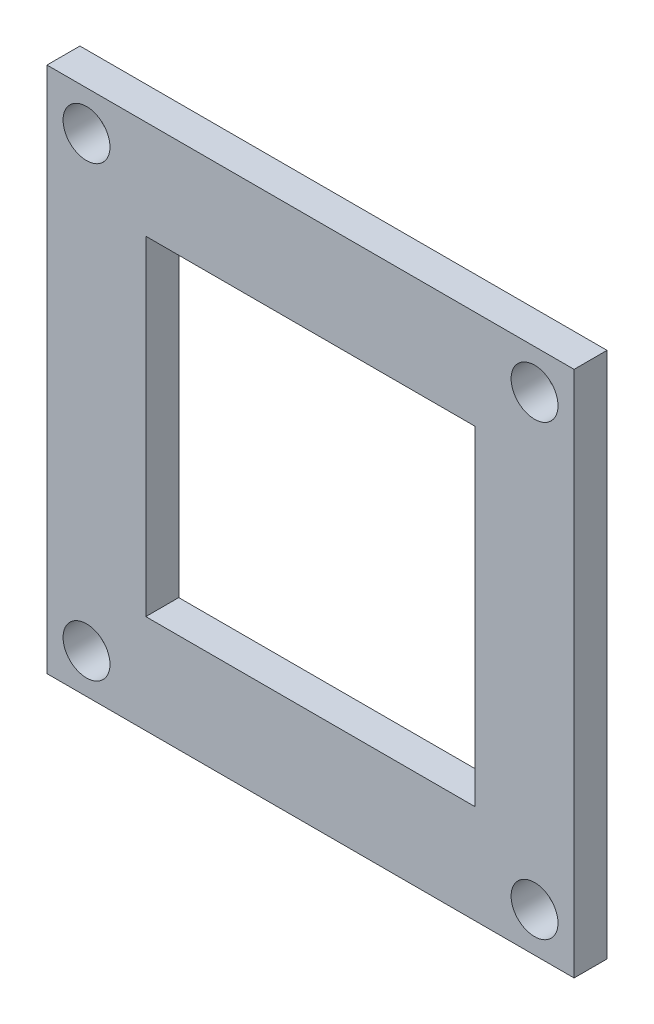
ISO-10303-21;
HEADER;
FILE_DESCRIPTION(('STEP AP214'),'2;1');
FILE_NAME('part.step','',(''),(''),'','','');
FILE_SCHEMA(('AUTOMOTIVE_DESIGN { 1 0 10303 214 1 1 1 1 }'));
ENDSEC;
DATA;
#1=APPLICATION_CONTEXT('core data for automotive mechanical design processes');
#2=APPLICATION_PROTOCOL_DEFINITION('international standard','automotive_design',2000,#1);
#3=PRODUCT_CONTEXT('',#1,'mechanical');
#4=PRODUCT('Part','Part','',(#3));
#5=PRODUCT_RELATED_PRODUCT_CATEGORY('part','',(#4));
#6=PRODUCT_DEFINITION_FORMATION('','',#4);
#7=PRODUCT_DEFINITION_CONTEXT('part definition',#1,'design');
#8=PRODUCT_DEFINITION('design','',#6,#7);
#9=PRODUCT_DEFINITION_SHAPE('','',#8);
#10=(LENGTH_UNIT() NAMED_UNIT(*) SI_UNIT(.MILLI.,.METRE.));
#11=(NAMED_UNIT(*) PLANE_ANGLE_UNIT() SI_UNIT($,.RADIAN.));
#12=(NAMED_UNIT(*) SI_UNIT($,.STERADIAN.) SOLID_ANGLE_UNIT());
#13=UNCERTAINTY_MEASURE_WITH_UNIT(LENGTH_MEASURE(1.E-05),#10,'distance_accuracy_value','');
#14=(GEOMETRIC_REPRESENTATION_CONTEXT(3) GLOBAL_UNCERTAINTY_ASSIGNED_CONTEXT((#13)) GLOBAL_UNIT_ASSIGNED_CONTEXT((#10,
#11,#12)) REPRESENTATION_CONTEXT('',''));
#15=CARTESIAN_POINT('',(0.,0.,0.));
#16=DIRECTION('',(0.,0.,1.));
#17=DIRECTION('',(1.,0.,0.));
#18=AXIS2_PLACEMENT_3D('',#15,#16,#17);
#19=CARTESIAN_POINT('',(0.,0.,1.5875));
#20=DIRECTION('',(0.,0.,1.));
#21=DIRECTION('',(1.,0.,0.));
#22=AXIS2_PLACEMENT_3D('',#19,#20,#21);
#23=PLANE('',#22);
#24=CARTESIAN_POINT('',(10.795,10.795,1.5875));
#25=DIRECTION('',(0.,0.,1.));
#26=DIRECTION('',(1.,0.,0.));
#27=AXIS2_PLACEMENT_3D('',#24,#25,#26);
#28=CIRCLE('',#27,1.1303);
#29=CARTESIAN_POINT('',(11.9253,10.795,1.5875));
#30=VERTEX_POINT('',#29);
#31=EDGE_CURVE('E239',#30,#30,#28,.T.);
#32=ORIENTED_EDGE('',*,*,#31,.F.);
#33=EDGE_LOOP('',(#32));
#34=FACE_BOUND('',#33,.T.);
#35=CARTESIAN_POINT('',(-10.795,10.795,1.5875));
#36=DIRECTION('',(0.,0.,1.));
#37=DIRECTION('',(1.,0.,0.));
#38=AXIS2_PLACEMENT_3D('',#35,#36,#37);
#39=CIRCLE('',#38,1.1303);
#40=CARTESIAN_POINT('',(-9.6647,10.795,1.5875));
#41=VERTEX_POINT('',#40);
#42=EDGE_CURVE('E241',#41,#41,#39,.T.);
#43=ORIENTED_EDGE('',*,*,#42,.F.);
#44=EDGE_LOOP('',(#43));
#45=FACE_BOUND('',#44,.T.);
#46=CARTESIAN_POINT('',(-10.795,-10.795,1.5875));
#47=DIRECTION('',(0.,0.,1.));
#48=DIRECTION('',(1.,0.,0.));
#49=AXIS2_PLACEMENT_3D('',#46,#47,#48);
#50=CIRCLE('',#49,1.1303);
#51=CARTESIAN_POINT('',(-9.6647,-10.795,1.5875));
#52=VERTEX_POINT('',#51);
#53=EDGE_CURVE('E249',#52,#52,#50,.T.);
#54=ORIENTED_EDGE('',*,*,#53,.F.);
#55=EDGE_LOOP('',(#54));
#56=FACE_BOUND('',#55,.T.);
#57=CARTESIAN_POINT('',(10.795,-10.795,1.5875));
#58=DIRECTION('',(0.,0.,1.));
#59=DIRECTION('',(1.,0.,0.));
#60=AXIS2_PLACEMENT_3D('',#57,#58,#59);
#61=CIRCLE('',#60,1.1303);
#62=CARTESIAN_POINT('',(11.9253,-10.795,1.5875));
#63=VERTEX_POINT('',#62);
#64=EDGE_CURVE('E255',#63,#63,#61,.T.);
#65=ORIENTED_EDGE('',*,*,#64,.F.);
#66=EDGE_LOOP('',(#65));
#67=FACE_BOUND('',#66,.T.);
#68=DIRECTION('',(0.,1.,0.));
#69=VECTOR('',#68,1.);
#70=CARTESIAN_POINT('',(12.7,12.7,1.5875));
#71=LINE('',#70,#69);
#72=CARTESIAN_POINT('',(12.7,-12.7,1.5875));
#73=VERTEX_POINT('',#72);
#74=CARTESIAN_POINT('',(12.7,12.7,1.5875));
#75=VERTEX_POINT('',#74);
#76=EDGE_CURVE('E136',#73,#75,#71,.T.);
#77=ORIENTED_EDGE('',*,*,#76,.T.);
#78=DIRECTION('',(-1.,0.,0.));
#79=VECTOR('',#78,1.);
#80=CARTESIAN_POINT('',(-12.7,12.7,1.5875));
#81=LINE('',#80,#79);
#82=CARTESIAN_POINT('',(-12.7,12.7,1.5875));
#83=VERTEX_POINT('',#82);
#84=EDGE_CURVE('E139',#75,#83,#81,.T.);
#85=ORIENTED_EDGE('',*,*,#84,.T.);
#86=DIRECTION('',(0.,-1.,0.));
#87=VECTOR('',#86,1.);
#88=CARTESIAN_POINT('',(-12.7,12.7,1.5875));
#89=LINE('',#88,#87);
#90=CARTESIAN_POINT('',(-12.7,-12.7,1.5875));
#91=VERTEX_POINT('',#90);
#92=EDGE_CURVE('E142',#83,#91,#89,.T.);
#93=ORIENTED_EDGE('',*,*,#92,.T.);
#94=DIRECTION('',(1.,0.,0.));
#95=VECTOR('',#94,1.);
#96=CARTESIAN_POINT('',(-12.7,-12.7,1.5875));
#97=LINE('',#96,#95);
#98=EDGE_CURVE('E144',#91,#73,#97,.T.);
#99=ORIENTED_EDGE('',*,*,#98,.T.);
#100=EDGE_LOOP('',(#77,#85,#93,#99));
#101=FACE_BOUND('',#100,.T.);
#102=DIRECTION('',(-1.,0.,0.));
#103=VECTOR('',#102,1.);
#104=CARTESIAN_POINT('',(-7.9375,7.9375,1.5875));
#105=LINE('',#104,#103);
#106=CARTESIAN_POINT('',(7.9375,7.9375,1.5875));
#107=VERTEX_POINT('',#106);
#108=CARTESIAN_POINT('',(-7.9375,7.9375,1.5875));
#109=VERTEX_POINT('',#108);
#110=EDGE_CURVE('E106',#107,#109,#105,.T.);
#111=ORIENTED_EDGE('',*,*,#110,.F.);
#112=DIRECTION('',(0.,1.,0.));
#113=VECTOR('',#112,1.);
#114=CARTESIAN_POINT('',(7.9375,7.9375,1.5875));
#115=LINE('',#114,#113);
#116=CARTESIAN_POINT('',(7.9375,-7.9375,1.5875));
#117=VERTEX_POINT('',#116);
#118=EDGE_CURVE('E98',#117,#107,#115,.T.);
#119=ORIENTED_EDGE('',*,*,#118,.F.);
#120=DIRECTION('',(1.,0.,0.));
#121=VECTOR('',#120,1.);
#122=CARTESIAN_POINT('',(-7.9375,-7.9375,1.5875));
#123=LINE('',#122,#121);
#124=CARTESIAN_POINT('',(-7.9375,-7.9375,1.5875));
#125=VERTEX_POINT('',#124);
#126=EDGE_CURVE('E120',#125,#117,#123,.T.);
#127=ORIENTED_EDGE('',*,*,#126,.F.);
#128=DIRECTION('',(0.,-1.,0.));
#129=VECTOR('',#128,1.);
#130=CARTESIAN_POINT('',(-7.9375,7.9375,1.5875));
#131=LINE('',#130,#129);
#132=EDGE_CURVE('E118',#109,#125,#131,.T.);
#133=ORIENTED_EDGE('',*,*,#132,.F.);
#134=EDGE_LOOP('',(#111,#119,#127,#133));
#135=FACE_BOUND('',#134,.T.);
#136=ADVANCED_FACE('F33',(#34,#45,#56,#67,#101,#135),#23,.T.);
#137=CARTESIAN_POINT('',(0.,0.,0.));
#138=DIRECTION('',(0.,0.,1.));
#139=DIRECTION('',(1.,0.,0.));
#140=AXIS2_PLACEMENT_3D('',#137,#138,#139);
#141=PLANE('',#140);
#142=CARTESIAN_POINT('',(10.795,10.795,0.));
#143=DIRECTION('',(0.,0.,1.));
#144=DIRECTION('',(1.,0.,0.));
#145=AXIS2_PLACEMENT_3D('',#142,#143,#144);
#146=CIRCLE('',#145,1.1303);
#147=CARTESIAN_POINT('',(11.9253,10.795,0.));
#148=VERTEX_POINT('',#147);
#149=EDGE_CURVE('E237',#148,#148,#146,.T.);
#150=ORIENTED_EDGE('',*,*,#149,.T.);
#151=EDGE_LOOP('',(#150));
#152=FACE_BOUND('',#151,.T.);
#153=CARTESIAN_POINT('',(-10.795,10.795,0.));
#154=DIRECTION('',(0.,0.,1.));
#155=DIRECTION('',(1.,0.,0.));
#156=AXIS2_PLACEMENT_3D('',#153,#154,#155);
#157=CIRCLE('',#156,1.1303);
#158=CARTESIAN_POINT('',(-9.66470000000001,10.795,0.));
#159=VERTEX_POINT('',#158);
#160=EDGE_CURVE('E246',#159,#159,#157,.T.);
#161=ORIENTED_EDGE('',*,*,#160,.T.);
#162=EDGE_LOOP('',(#161));
#163=FACE_BOUND('',#162,.T.);
#164=CARTESIAN_POINT('',(-10.795,-10.795,0.));
#165=DIRECTION('',(0.,0.,1.));
#166=DIRECTION('',(1.,0.,0.));
#167=AXIS2_PLACEMENT_3D('',#164,#165,#166);
#168=CIRCLE('',#167,1.1303);
#169=CARTESIAN_POINT('',(-9.6647,-10.795,0.));
#170=VERTEX_POINT('',#169);
#171=EDGE_CURVE('E252',#170,#170,#168,.T.);
#172=ORIENTED_EDGE('',*,*,#171,.T.);
#173=EDGE_LOOP('',(#172));
#174=FACE_BOUND('',#173,.T.);
#175=CARTESIAN_POINT('',(10.795,-10.795,0.));
#176=DIRECTION('',(0.,0.,1.));
#177=DIRECTION('',(1.,0.,0.));
#178=AXIS2_PLACEMENT_3D('',#175,#176,#177);
#179=CIRCLE('',#178,1.1303);
#180=CARTESIAN_POINT('',(11.9253,-10.795,0.));
#181=VERTEX_POINT('',#180);
#182=EDGE_CURVE('E126',#181,#181,#179,.T.);
#183=ORIENTED_EDGE('',*,*,#182,.T.);
#184=EDGE_LOOP('',(#183));
#185=FACE_BOUND('',#184,.T.);
#186=DIRECTION('',(0.,1.,0.));
#187=VECTOR('',#186,1.);
#188=CARTESIAN_POINT('',(12.7,12.7,0.));
#189=LINE('',#188,#187);
#190=CARTESIAN_POINT('',(12.7,-12.7,0.));
#191=VERTEX_POINT('',#190);
#192=CARTESIAN_POINT('',(12.7,12.7,0.));
#193=VERTEX_POINT('',#192);
#194=EDGE_CURVE('E114',#191,#193,#189,.T.);
#195=ORIENTED_EDGE('',*,*,#194,.F.);
#196=DIRECTION('',(1.,0.,0.));
#197=VECTOR('',#196,1.);
#198=CARTESIAN_POINT('',(-12.7,-12.7,0.));
#199=LINE('',#198,#197);
#200=CARTESIAN_POINT('',(-12.7,-12.7,0.));
#201=VERTEX_POINT('',#200);
#202=EDGE_CURVE('E140',#201,#191,#199,.T.);
#203=ORIENTED_EDGE('',*,*,#202,.F.);
#204=DIRECTION('',(0.,-1.,0.));
#205=VECTOR('',#204,1.);
#206=CARTESIAN_POINT('',(-12.7,12.7,0.));
#207=LINE('',#206,#205);
#208=CARTESIAN_POINT('',(-12.7,12.7,0.));
#209=VERTEX_POINT('',#208);
#210=EDGE_CURVE('E151',#209,#201,#207,.T.);
#211=ORIENTED_EDGE('',*,*,#210,.F.);
#212=DIRECTION('',(-1.,0.,0.));
#213=VECTOR('',#212,1.);
#214=CARTESIAN_POINT('',(-12.7,12.7,0.));
#215=LINE('',#214,#213);
#216=EDGE_CURVE('E149',#193,#209,#215,.T.);
#217=ORIENTED_EDGE('',*,*,#216,.F.);
#218=EDGE_LOOP('',(#195,#203,#211,#217));
#219=FACE_BOUND('',#218,.T.);
#220=DIRECTION('',(0.,1.,0.));
#221=VECTOR('',#220,1.);
#222=CARTESIAN_POINT('',(7.9375,7.9375,0.));
#223=LINE('',#222,#221);
#224=CARTESIAN_POINT('',(7.9375,-7.9375,0.));
#225=VERTEX_POINT('',#224);
#226=CARTESIAN_POINT('',(7.9375,7.9375,0.));
#227=VERTEX_POINT('',#226);
#228=EDGE_CURVE('E56',#225,#227,#223,.T.);
#229=ORIENTED_EDGE('',*,*,#228,.T.);
#230=DIRECTION('',(-1.,0.,0.));
#231=VECTOR('',#230,1.);
#232=CARTESIAN_POINT('',(-7.9375,7.9375,0.));
#233=LINE('',#232,#231);
#234=CARTESIAN_POINT('',(-7.9375,7.9375,0.));
#235=VERTEX_POINT('',#234);
#236=EDGE_CURVE('E113',#227,#235,#233,.T.);
#237=ORIENTED_EDGE('',*,*,#236,.T.);
#238=DIRECTION('',(0.,-1.,0.));
#239=VECTOR('',#238,1.);
#240=CARTESIAN_POINT('',(-7.9375,7.9375,0.));
#241=LINE('',#240,#239);
#242=CARTESIAN_POINT('',(-7.9375,-7.9375,0.));
#243=VERTEX_POINT('',#242);
#244=EDGE_CURVE('E128',#235,#243,#241,.T.);
#245=ORIENTED_EDGE('',*,*,#244,.T.);
#246=DIRECTION('',(1.,0.,0.));
#247=VECTOR('',#246,1.);
#248=CARTESIAN_POINT('',(-7.9375,-7.9375,0.));
#249=LINE('',#248,#247);
#250=EDGE_CURVE('E107',#243,#225,#249,.T.);
#251=ORIENTED_EDGE('',*,*,#250,.T.);
#252=EDGE_LOOP('',(#229,#237,#245,#251));
#253=FACE_BOUND('',#252,.T.);
#254=ADVANCED_FACE('F169',(#152,#163,#174,#185,#219,#253),#141,.F.);
#255=CARTESIAN_POINT('',(12.7,12.7,1.5875));
#256=DIRECTION('',(-1.,0.,0.));
#257=DIRECTION('',(0.,-1.,0.));
#258=AXIS2_PLACEMENT_3D('',#255,#256,#257);
#259=PLANE('',#258);
#260=ORIENTED_EDGE('',*,*,#194,.T.);
#261=DIRECTION('',(0.,0.,-1.));
#262=VECTOR('',#261,1.);
#263=CARTESIAN_POINT('',(12.7,12.7,1.5875));
#264=LINE('',#263,#262);
#265=EDGE_CURVE('E11',#75,#193,#264,.T.);
#266=ORIENTED_EDGE('',*,*,#265,.F.);
#267=ORIENTED_EDGE('',*,*,#76,.F.);
#268=DIRECTION('',(0.,0.,-1.));
#269=VECTOR('',#268,1.);
#270=CARTESIAN_POINT('',(12.7,-12.7,1.5875));
#271=LINE('',#270,#269);
#272=EDGE_CURVE('E146',#73,#191,#271,.T.);
#273=ORIENTED_EDGE('',*,*,#272,.T.);
#274=EDGE_LOOP('',(#260,#266,#267,#273));
#275=FACE_BOUND('',#274,.T.);
#276=ADVANCED_FACE('F35',(#275),#259,.F.);
#277=CARTESIAN_POINT('',(-12.7,12.7,1.5875));
#278=DIRECTION('',(0.,-1.,0.));
#279=DIRECTION('',(0.,0.,-1.));
#280=AXIS2_PLACEMENT_3D('',#277,#278,#279);
#281=PLANE('',#280);
#282=ORIENTED_EDGE('',*,*,#216,.T.);
#283=DIRECTION('',(0.,0.,-1.));
#284=VECTOR('',#283,1.);
#285=CARTESIAN_POINT('',(-12.7,12.7,1.5875));
#286=LINE('',#285,#284);
#287=EDGE_CURVE('E41',#83,#209,#286,.T.);
#288=ORIENTED_EDGE('',*,*,#287,.F.);
#289=ORIENTED_EDGE('',*,*,#84,.F.);
#290=ORIENTED_EDGE('',*,*,#265,.T.);
#291=EDGE_LOOP('',(#282,#288,#289,#290));
#292=FACE_BOUND('',#291,.T.);
#293=ADVANCED_FACE('F179',(#292),#281,.F.);
#294=CARTESIAN_POINT('',(-12.7,12.7,1.5875));
#295=DIRECTION('',(1.,0.,0.));
#296=DIRECTION('',(0.,1.,0.));
#297=AXIS2_PLACEMENT_3D('',#294,#295,#296);
#298=PLANE('',#297);
#299=ORIENTED_EDGE('',*,*,#210,.T.);
#300=DIRECTION('',(0.,0.,-1.));
#301=VECTOR('',#300,1.);
#302=CARTESIAN_POINT('',(-12.7,-12.7,1.5875));
#303=LINE('',#302,#301);
#304=EDGE_CURVE('E156',#91,#201,#303,.T.);
#305=ORIENTED_EDGE('',*,*,#304,.F.);
#306=ORIENTED_EDGE('',*,*,#92,.F.);
#307=ORIENTED_EDGE('',*,*,#287,.T.);
#308=EDGE_LOOP('',(#299,#305,#306,#307));
#309=FACE_BOUND('',#308,.T.);
#310=ADVANCED_FACE('F163',(#309),#298,.F.);
#311=CARTESIAN_POINT('',(-12.7,-12.7,1.5875));
#312=DIRECTION('',(0.,1.,0.));
#313=DIRECTION('',(0.,0.,1.));
#314=AXIS2_PLACEMENT_3D('',#311,#312,#313);
#315=PLANE('',#314);
#316=ORIENTED_EDGE('',*,*,#202,.T.);
#317=ORIENTED_EDGE('',*,*,#272,.F.);
#318=ORIENTED_EDGE('',*,*,#98,.F.);
#319=ORIENTED_EDGE('',*,*,#304,.T.);
#320=EDGE_LOOP('',(#316,#317,#318,#319));
#321=FACE_BOUND('',#320,.T.);
#322=ADVANCED_FACE('F173',(#321),#315,.F.);
#323=CARTESIAN_POINT('',(7.9375,7.9375,1.5875));
#324=DIRECTION('',(-1.,0.,0.));
#325=DIRECTION('',(0.,-1.,0.));
#326=AXIS2_PLACEMENT_3D('',#323,#324,#325);
#327=PLANE('',#326);
#328=ORIENTED_EDGE('',*,*,#228,.F.);
#329=DIRECTION('',(0.,0.,-1.));
#330=VECTOR('',#329,1.);
#331=CARTESIAN_POINT('',(7.9375,-7.9375,1.5875));
#332=LINE('',#331,#330);
#333=EDGE_CURVE('E102',#117,#225,#332,.T.);
#334=ORIENTED_EDGE('',*,*,#333,.F.);
#335=ORIENTED_EDGE('',*,*,#118,.T.);
#336=DIRECTION('',(0.,0.,-1.));
#337=VECTOR('',#336,1.);
#338=CARTESIAN_POINT('',(7.9375,7.9375,1.5875));
#339=LINE('',#338,#337);
#340=EDGE_CURVE('E101',#107,#227,#339,.T.);
#341=ORIENTED_EDGE('',*,*,#340,.T.);
#342=EDGE_LOOP('',(#328,#334,#335,#341));
#343=FACE_BOUND('',#342,.T.);
#344=ADVANCED_FACE('F100',(#343),#327,.T.);
#345=CARTESIAN_POINT('',(-7.9375,7.9375,1.5875));
#346=DIRECTION('',(0.,-1.,0.));
#347=DIRECTION('',(0.,0.,-1.));
#348=AXIS2_PLACEMENT_3D('',#345,#346,#347);
#349=PLANE('',#348);
#350=ORIENTED_EDGE('',*,*,#236,.F.);
#351=ORIENTED_EDGE('',*,*,#340,.F.);
#352=ORIENTED_EDGE('',*,*,#110,.T.);
#353=DIRECTION('',(0.,0.,-1.));
#354=VECTOR('',#353,1.);
#355=CARTESIAN_POINT('',(-7.9375,7.9375,1.5875));
#356=LINE('',#355,#354);
#357=EDGE_CURVE('E115',#109,#235,#356,.T.);
#358=ORIENTED_EDGE('',*,*,#357,.T.);
#359=EDGE_LOOP('',(#350,#351,#352,#358));
#360=FACE_BOUND('',#359,.T.);
#361=ADVANCED_FACE('F110',(#360),#349,.T.);
#362=CARTESIAN_POINT('',(-7.9375,7.9375,1.5875));
#363=DIRECTION('',(1.,0.,0.));
#364=DIRECTION('',(0.,1.,0.));
#365=AXIS2_PLACEMENT_3D('',#362,#363,#364);
#366=PLANE('',#365);
#367=ORIENTED_EDGE('',*,*,#244,.F.);
#368=ORIENTED_EDGE('',*,*,#357,.F.);
#369=ORIENTED_EDGE('',*,*,#132,.T.);
#370=DIRECTION('',(0.,0.,-1.));
#371=VECTOR('',#370,1.);
#372=CARTESIAN_POINT('',(-7.9375,-7.9375,1.5875));
#373=LINE('',#372,#371);
#374=EDGE_CURVE('E48',#125,#243,#373,.T.);
#375=ORIENTED_EDGE('',*,*,#374,.T.);
#376=EDGE_LOOP('',(#367,#368,#369,#375));
#377=FACE_BOUND('',#376,.T.);
#378=ADVANCED_FACE('F207',(#377),#366,.T.);
#379=CARTESIAN_POINT('',(-7.9375,-7.9375,1.5875));
#380=DIRECTION('',(0.,1.,0.));
#381=DIRECTION('',(0.,0.,1.));
#382=AXIS2_PLACEMENT_3D('',#379,#380,#381);
#383=PLANE('',#382);
#384=ORIENTED_EDGE('',*,*,#250,.F.);
#385=ORIENTED_EDGE('',*,*,#374,.F.);
#386=ORIENTED_EDGE('',*,*,#126,.T.);
#387=ORIENTED_EDGE('',*,*,#333,.T.);
#388=EDGE_LOOP('',(#384,#385,#386,#387));
#389=FACE_BOUND('',#388,.T.);
#390=ADVANCED_FACE('F211',(#389),#383,.T.);
#391=CARTESIAN_POINT('',(10.795,-10.795,1.5875));
#392=DIRECTION('',(0.,0.,1.));
#393=DIRECTION('',(1.,0.,0.));
#394=AXIS2_PLACEMENT_3D('',#391,#392,#393);
#395=CYLINDRICAL_SURFACE('',#394,1.1303);
#396=ORIENTED_EDGE('',*,*,#182,.F.);
#397=EDGE_LOOP('',(#396));
#398=FACE_BOUND('',#397,.T.);
#399=ORIENTED_EDGE('',*,*,#64,.T.);
#400=EDGE_LOOP('',(#399));
#401=FACE_BOUND('',#400,.T.);
#402=ADVANCED_FACE('F217',(#398,#401),#395,.F.);
#403=CARTESIAN_POINT('',(-10.795,-10.795,1.5875));
#404=DIRECTION('',(0.,0.,1.));
#405=DIRECTION('',(1.,0.,0.));
#406=AXIS2_PLACEMENT_3D('',#403,#404,#405);
#407=CYLINDRICAL_SURFACE('',#406,1.1303);
#408=ORIENTED_EDGE('',*,*,#171,.F.);
#409=EDGE_LOOP('',(#408));
#410=FACE_BOUND('',#409,.T.);
#411=ORIENTED_EDGE('',*,*,#53,.T.);
#412=EDGE_LOOP('',(#411));
#413=FACE_BOUND('',#412,.T.);
#414=ADVANCED_FACE('F220',(#410,#413),#407,.F.);
#415=CARTESIAN_POINT('',(-10.795,10.795,1.5875));
#416=DIRECTION('',(0.,0.,1.));
#417=DIRECTION('',(1.,0.,0.));
#418=AXIS2_PLACEMENT_3D('',#415,#416,#417);
#419=CYLINDRICAL_SURFACE('',#418,1.1303);
#420=ORIENTED_EDGE('',*,*,#160,.F.);
#421=EDGE_LOOP('',(#420));
#422=FACE_BOUND('',#421,.T.);
#423=ORIENTED_EDGE('',*,*,#42,.T.);
#424=EDGE_LOOP('',(#423));
#425=FACE_BOUND('',#424,.T.);
#426=ADVANCED_FACE('F224',(#422,#425),#419,.F.);
#427=CARTESIAN_POINT('',(10.795,10.795,1.5875));
#428=DIRECTION('',(0.,0.,1.));
#429=DIRECTION('',(1.,0.,0.));
#430=AXIS2_PLACEMENT_3D('',#427,#428,#429);
#431=CYLINDRICAL_SURFACE('',#430,1.1303);
#432=ORIENTED_EDGE('',*,*,#149,.F.);
#433=EDGE_LOOP('',(#432));
#434=FACE_BOUND('',#433,.T.);
#435=ORIENTED_EDGE('',*,*,#31,.T.);
#436=EDGE_LOOP('',(#435));
#437=FACE_BOUND('',#436,.T.);
#438=ADVANCED_FACE('F228',(#434,#437),#431,.F.);
#439=CLOSED_SHELL('',(#136,#254,#276,#293,#310,#322,#344,#361,#378,#390,#402,#414,#426,#438));
#440=MANIFOLD_SOLID_BREP('B2',#439);
#441=ADVANCED_BREP_SHAPE_REPRESENTATION('',(#18,#440),#14);
#442=SHAPE_DEFINITION_REPRESENTATION(#9,#441);
ENDSEC;
END-ISO-10303-21;
